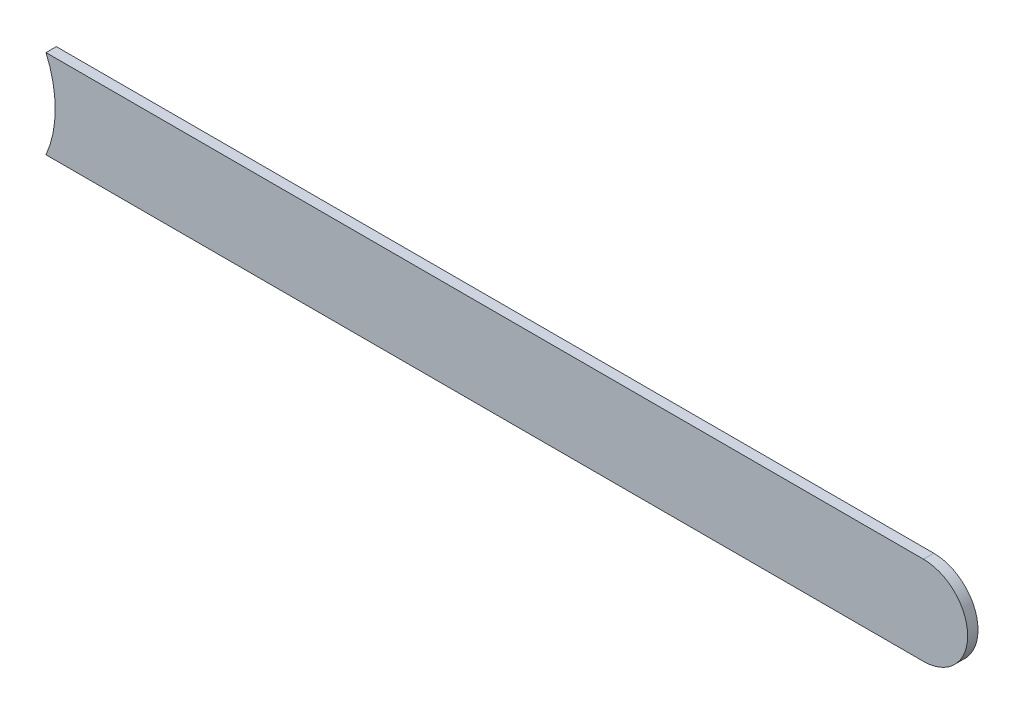
ISO-10303-21;
HEADER;
FILE_DESCRIPTION(('STEP AP214'),'2;1');
FILE_NAME('part.step','',(''),(''),'','','');
FILE_SCHEMA(('AUTOMOTIVE_DESIGN { 1 0 10303 214 1 1 1 1 }'));
ENDSEC;
DATA;
#1=APPLICATION_CONTEXT('core data for automotive mechanical design processes');
#2=APPLICATION_PROTOCOL_DEFINITION('international standard','automotive_design',2000,#1);
#3=PRODUCT_CONTEXT('',#1,'mechanical');
#4=PRODUCT('Part','Part','',(#3));
#5=PRODUCT_RELATED_PRODUCT_CATEGORY('part','',(#4));
#6=PRODUCT_DEFINITION_FORMATION('','',#4);
#7=PRODUCT_DEFINITION_CONTEXT('part definition',#1,'design');
#8=PRODUCT_DEFINITION('design','',#6,#7);
#9=PRODUCT_DEFINITION_SHAPE('','',#8);
#10=(LENGTH_UNIT() NAMED_UNIT(*) SI_UNIT(.MILLI.,.METRE.));
#11=(NAMED_UNIT(*) PLANE_ANGLE_UNIT() SI_UNIT($,.RADIAN.));
#12=(NAMED_UNIT(*) SI_UNIT($,.STERADIAN.) SOLID_ANGLE_UNIT());
#13=UNCERTAINTY_MEASURE_WITH_UNIT(LENGTH_MEASURE(1.E-05),#10,'distance_accuracy_value','');
#14=(GEOMETRIC_REPRESENTATION_CONTEXT(3) GLOBAL_UNCERTAINTY_ASSIGNED_CONTEXT((#13)) GLOBAL_UNIT_ASSIGNED_CONTEXT((#10,
#11,#12)) REPRESENTATION_CONTEXT('',''));
#15=CARTESIAN_POINT('',(0.,0.,0.));
#16=DIRECTION('',(0.,0.,1.));
#17=DIRECTION('',(1.,0.,0.));
#18=AXIS2_PLACEMENT_3D('',#15,#16,#17);
#19=CARTESIAN_POINT('',(168.9246,-72.494,-0.035));
#20=DIRECTION('',(0.,-1.,0.));
#21=DIRECTION('',(0.,0.,-1.));
#22=AXIS2_PLACEMENT_3D('',#19,#20,#21);
#23=PLANE('',#22);
#24=DIRECTION('',(0.,0.,-1.));
#25=VECTOR('',#24,1.);
#26=CARTESIAN_POINT('',(165.95169317712,-72.494,-0.045));
#27=LINE('',#26,#25);
#28=CARTESIAN_POINT('',(165.95169317713,-72.494,0.));
#29=VERTEX_POINT('',#28);
#30=CARTESIAN_POINT('',(165.95169317713,-72.494,-0.035));
#31=VERTEX_POINT('',#30);
#32=EDGE_CURVE('E11',#29,#31,#27,.T.);
#33=ORIENTED_EDGE('',*,*,#32,.F.);
#34=DIRECTION('',(-1.,0.,0.));
#35=VECTOR('',#34,1.);
#36=CARTESIAN_POINT('',(168.9246,-72.494,0.));
#37=LINE('',#36,#35);
#38=CARTESIAN_POINT('',(168.9246,-72.494,0.));
#39=VERTEX_POINT('',#38);
#40=EDGE_CURVE('E21',#39,#29,#37,.T.);
#41=ORIENTED_EDGE('',*,*,#40,.F.);
#42=DIRECTION('',(0.,0.,1.));
#43=VECTOR('',#42,1.);
#44=CARTESIAN_POINT('',(168.9246,-72.494,-0.035));
#45=LINE('',#44,#43);
#46=CARTESIAN_POINT('',(168.9246,-72.494,-0.035));
#47=VERTEX_POINT('',#46);
#48=EDGE_CURVE('E110',#47,#39,#45,.T.);
#49=ORIENTED_EDGE('',*,*,#48,.F.);
#50=DIRECTION('',(-1.,0.,0.));
#51=VECTOR('',#50,1.);
#52=CARTESIAN_POINT('',(168.9246,-72.494,-0.035));
#53=LINE('',#52,#51);
#54=EDGE_CURVE('E76',#47,#31,#53,.T.);
#55=ORIENTED_EDGE('',*,*,#54,.T.);
#56=EDGE_LOOP('',(#33,#41,#49,#55));
#57=FACE_BOUND('',#56,.T.);
#58=ADVANCED_FACE('F17',(#57),#23,.F.);
#59=CARTESIAN_POINT('',(165.608,-72.644,-0.045));
#60=DIRECTION('',(0.,0.,-1.));
#61=DIRECTION('',(0.,-1.,0.));
#62=AXIS2_PLACEMENT_3D('',#59,#60,#61);
#63=CYLINDRICAL_SURFACE('',#62,0.375);
#64=DIRECTION('',(0.,0.,-1.));
#65=VECTOR('',#64,1.);
#66=CARTESIAN_POINT('',(165.95169317712,-72.794,-0.045));
#67=LINE('',#66,#65);
#68=CARTESIAN_POINT('',(165.95169317711,-72.794,0.));
#69=VERTEX_POINT('',#68);
#70=CARTESIAN_POINT('',(165.95169317711,-72.794,-0.035));
#71=VERTEX_POINT('',#70);
#72=EDGE_CURVE('E89',#69,#71,#67,.T.);
#73=ORIENTED_EDGE('',*,*,#72,.F.);
#74=CARTESIAN_POINT('',(165.608,-72.644,0.));
#75=DIRECTION('',(0.,0.,-1.));
#76=DIRECTION('',(0.,-1.,0.));
#77=AXIS2_PLACEMENT_3D('',#74,#75,#76);
#78=CIRCLE('',#77,0.375);
#79=EDGE_CURVE('E114',#29,#69,#78,.T.);
#80=ORIENTED_EDGE('',*,*,#79,.F.);
#81=ORIENTED_EDGE('',*,*,#32,.T.);
#82=CARTESIAN_POINT('',(165.608,-72.644,-0.035));
#83=DIRECTION('',(0.,0.,-1.));
#84=DIRECTION('',(0.,-1.,0.));
#85=AXIS2_PLACEMENT_3D('',#82,#83,#84);
#86=CIRCLE('',#85,0.375);
#87=EDGE_CURVE('E81',#31,#71,#86,.T.);
#88=ORIENTED_EDGE('',*,*,#87,.T.);
#89=EDGE_LOOP('',(#73,#80,#81,#88));
#90=FACE_BOUND('',#89,.T.);
#91=ADVANCED_FACE('F19',(#90),#63,.F.);
#92=CARTESIAN_POINT('',(165.608,-72.794,0.));
#93=DIRECTION('',(0.,0.,1.));
#94=DIRECTION('',(1.,0.,0.));
#95=AXIS2_PLACEMENT_3D('',#92,#93,#94);
#96=PLANE('',#95);
#97=ORIENTED_EDGE('',*,*,#79,.T.);
#98=DIRECTION('',(1.,0.,0.));
#99=VECTOR('',#98,1.);
#100=CARTESIAN_POINT('',(165.608,-72.794,0.));
#101=LINE('',#100,#99);
#102=CARTESIAN_POINT('',(168.9246,-72.794,0.));
#103=VERTEX_POINT('',#102);
#104=EDGE_CURVE('E96',#69,#103,#101,.T.);
#105=ORIENTED_EDGE('',*,*,#104,.T.);
#106=CARTESIAN_POINT('',(168.9246,-72.644,0.));
#107=DIRECTION('',(0.,0.,1.));
#108=DIRECTION('',(0.,-1.,0.));
#109=AXIS2_PLACEMENT_3D('',#106,#107,#108);
#110=CIRCLE('',#109,0.15);
#111=EDGE_CURVE('E93',#103,#39,#110,.T.);
#112=ORIENTED_EDGE('',*,*,#111,.T.);
#113=ORIENTED_EDGE('',*,*,#40,.T.);
#114=EDGE_LOOP('',(#97,#105,#112,#113));
#115=FACE_BOUND('',#114,.T.);
#116=ADVANCED_FACE('F123',(#115),#96,.T.);
#117=CARTESIAN_POINT('',(168.9246,-72.644,-0.035));
#118=DIRECTION('',(0.,0.,-1.));
#119=DIRECTION('',(0.,-1.,0.));
#120=AXIS2_PLACEMENT_3D('',#117,#118,#119);
#121=CYLINDRICAL_SURFACE('',#120,0.15);
#122=CARTESIAN_POINT('',(168.9246,-72.644,-0.035));
#123=DIRECTION('',(0.,0.,1.));
#124=DIRECTION('',(0.,-1.,0.));
#125=AXIS2_PLACEMENT_3D('',#122,#123,#124);
#126=CIRCLE('',#125,0.15);
#127=CARTESIAN_POINT('',(168.9246,-72.794,-0.035));
#128=VERTEX_POINT('',#127);
#129=EDGE_CURVE('E70',#128,#47,#126,.T.);
#130=ORIENTED_EDGE('',*,*,#129,.T.);
#131=ORIENTED_EDGE('',*,*,#48,.T.);
#132=ORIENTED_EDGE('',*,*,#111,.F.);
#133=DIRECTION('',(0.,0.,1.));
#134=VECTOR('',#133,1.);
#135=CARTESIAN_POINT('',(168.9246,-72.794,-0.035));
#136=LINE('',#135,#134);
#137=EDGE_CURVE('E87',#128,#103,#136,.T.);
#138=ORIENTED_EDGE('',*,*,#137,.F.);
#139=EDGE_LOOP('',(#130,#131,#132,#138));
#140=FACE_BOUND('',#139,.T.);
#141=ADVANCED_FACE('F92',(#140),#121,.T.);
#142=CARTESIAN_POINT('',(165.608,-72.794,-0.035));
#143=DIRECTION('',(0.,0.,1.));
#144=DIRECTION('',(1.,0.,0.));
#145=AXIS2_PLACEMENT_3D('',#142,#143,#144);
#146=PLANE('',#145);
#147=ORIENTED_EDGE('',*,*,#54,.F.);
#148=ORIENTED_EDGE('',*,*,#129,.F.);
#149=DIRECTION('',(1.,0.,0.));
#150=VECTOR('',#149,1.);
#151=CARTESIAN_POINT('',(165.608,-72.794,-0.035));
#152=LINE('',#151,#150);
#153=EDGE_CURVE('E74',#71,#128,#152,.T.);
#154=ORIENTED_EDGE('',*,*,#153,.F.);
#155=ORIENTED_EDGE('',*,*,#87,.F.);
#156=EDGE_LOOP('',(#147,#148,#154,#155));
#157=FACE_BOUND('',#156,.T.);
#158=ADVANCED_FACE('F72',(#157),#146,.F.);
#159=CARTESIAN_POINT('',(165.608,-72.794,-0.035));
#160=DIRECTION('',(0.,1.,0.));
#161=DIRECTION('',(1.,0.,0.));
#162=AXIS2_PLACEMENT_3D('',#159,#160,#161);
#163=PLANE('',#162);
#164=ORIENTED_EDGE('',*,*,#137,.T.);
#165=ORIENTED_EDGE('',*,*,#104,.F.);
#166=ORIENTED_EDGE('',*,*,#72,.T.);
#167=ORIENTED_EDGE('',*,*,#153,.T.);
#168=EDGE_LOOP('',(#164,#165,#166,#167));
#169=FACE_BOUND('',#168,.T.);
#170=ADVANCED_FACE('F85',(#169),#163,.F.);
#171=CLOSED_SHELL('',(#58,#91,#116,#141,#158,#170));
#172=MANIFOLD_SOLID_BREP('B1',#171);
#173=ADVANCED_BREP_SHAPE_REPRESENTATION('',(#18,#172),#14);
#174=SHAPE_DEFINITION_REPRESENTATION(#9,#173);
ENDSEC;
END-ISO-10303-21;
